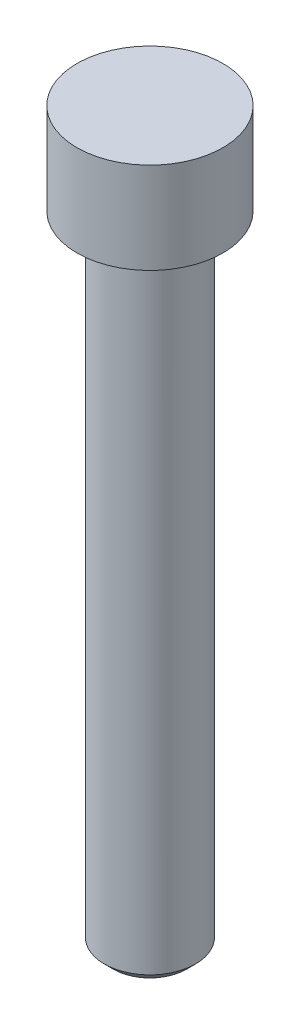
ISO-10303-21;
HEADER;
FILE_DESCRIPTION(('STEP AP214'),'2;1');
FILE_NAME('part.step','',(''),(''),'','','');
FILE_SCHEMA(('AUTOMOTIVE_DESIGN { 1 0 10303 214 1 1 1 1 }'));
ENDSEC;
DATA;
#1=APPLICATION_CONTEXT('core data for automotive mechanical design processes');
#2=APPLICATION_PROTOCOL_DEFINITION('international standard','automotive_design',2000,#1);
#3=PRODUCT_CONTEXT('',#1,'mechanical');
#4=PRODUCT('Part','Part','',(#3));
#5=PRODUCT_RELATED_PRODUCT_CATEGORY('part','',(#4));
#6=PRODUCT_DEFINITION_FORMATION('','',#4);
#7=PRODUCT_DEFINITION_CONTEXT('part definition',#1,'design');
#8=PRODUCT_DEFINITION('design','',#6,#7);
#9=PRODUCT_DEFINITION_SHAPE('','',#8);
#10=(LENGTH_UNIT() NAMED_UNIT(*) SI_UNIT(.MILLI.,.METRE.));
#11=(NAMED_UNIT(*) PLANE_ANGLE_UNIT() SI_UNIT($,.RADIAN.));
#12=(NAMED_UNIT(*) SI_UNIT($,.STERADIAN.) SOLID_ANGLE_UNIT());
#13=UNCERTAINTY_MEASURE_WITH_UNIT(LENGTH_MEASURE(1.E-05),#10,'distance_accuracy_value','');
#14=(GEOMETRIC_REPRESENTATION_CONTEXT(3) GLOBAL_UNCERTAINTY_ASSIGNED_CONTEXT((#13)) GLOBAL_UNIT_ASSIGNED_CONTEXT((#10,
#11,#12)) REPRESENTATION_CONTEXT('',''));
#15=CARTESIAN_POINT('',(0.,0.,0.));
#16=DIRECTION('',(0.,0.,1.));
#17=DIRECTION('',(1.,0.,0.));
#18=AXIS2_PLACEMENT_3D('',#15,#16,#17);
#19=CARTESIAN_POINT('',(0.,10.,0.));
#20=DIRECTION('',(0.,-1.,0.));
#21=DIRECTION('',(0.,0.,-1.));
#22=AXIS2_PLACEMENT_3D('',#19,#20,#21);
#23=CYLINDRICAL_SURFACE('',#22,8.);
#24=CARTESIAN_POINT('',(0.,10.,0.));
#25=DIRECTION('',(0.,1.,0.));
#26=DIRECTION('',(0.,0.,1.));
#27=AXIS2_PLACEMENT_3D('',#24,#25,#26);
#28=CIRCLE('',#27,8.);
#29=CARTESIAN_POINT('',(0.,10.,8.));
#30=VERTEX_POINT('',#29);
#31=EDGE_CURVE('E45',#30,#30,#28,.T.);
#32=ORIENTED_EDGE('',*,*,#31,.F.);
#33=EDGE_LOOP('',(#32));
#34=FACE_BOUND('',#33,.T.);
#35=CARTESIAN_POINT('',(0.,0.,0.));
#36=DIRECTION('',(0.,1.,0.));
#37=DIRECTION('',(0.,0.,1.));
#38=AXIS2_PLACEMENT_3D('',#35,#36,#37);
#39=CIRCLE('',#38,8.);
#40=CARTESIAN_POINT('',(0.,0.,8.));
#41=VERTEX_POINT('',#40);
#42=EDGE_CURVE('E48',#41,#41,#39,.T.);
#43=ORIENTED_EDGE('',*,*,#42,.T.);
#44=EDGE_LOOP('',(#43));
#45=FACE_BOUND('',#44,.T.);
#46=ADVANCED_FACE('F30',(#34,#45),#23,.T.);
#47=CARTESIAN_POINT('',(0.,10.,0.));
#48=DIRECTION('',(0.,1.,0.));
#49=DIRECTION('',(0.,0.,1.));
#50=AXIS2_PLACEMENT_3D('',#47,#48,#49);
#51=PLANE('',#50);
#52=ORIENTED_EDGE('',*,*,#31,.T.);
#53=EDGE_LOOP('',(#52));
#54=FACE_BOUND('',#53,.T.);
#55=ADVANCED_FACE('F54',(#54),#51,.T.);
#56=CARTESIAN_POINT('',(0.,0.,0.));
#57=DIRECTION('',(0.,1.,0.));
#58=DIRECTION('',(0.,0.,1.));
#59=AXIS2_PLACEMENT_3D('',#56,#57,#58);
#60=PLANE('',#59);
#61=CARTESIAN_POINT('',(0.,0.,0.));
#62=DIRECTION('',(0.,1.,0.));
#63=DIRECTION('',(0.,0.,1.));
#64=AXIS2_PLACEMENT_3D('',#61,#62,#63);
#65=CIRCLE('',#64,5.);
#66=CARTESIAN_POINT('',(0.,0.,5.));
#67=VERTEX_POINT('',#66);
#68=EDGE_CURVE('E41',#67,#67,#65,.F.);
#69=ORIENTED_EDGE('',*,*,#68,.F.);
#70=EDGE_LOOP('',(#69));
#71=FACE_BOUND('',#70,.T.);
#72=ORIENTED_EDGE('',*,*,#42,.F.);
#73=EDGE_LOOP('',(#72));
#74=FACE_BOUND('',#73,.T.);
#75=ADVANCED_FACE('F60',(#71,#74),#60,.F.);
#76=CARTESIAN_POINT('',(0.,-70.,0.));
#77=DIRECTION('',(0.,1.,0.));
#78=DIRECTION('',(0.,0.,1.));
#79=AXIS2_PLACEMENT_3D('',#76,#77,#78);
#80=CYLINDRICAL_SURFACE('',#79,5.);
#81=CARTESIAN_POINT('',(0.,-69.,0.));
#82=DIRECTION('',(0.,-1.,0.));
#83=DIRECTION('',(0.,0.,-1.));
#84=AXIS2_PLACEMENT_3D('',#81,#82,#83);
#85=CIRCLE('',#84,5.);
#86=CARTESIAN_POINT('',(0.,-69.,-5.));
#87=VERTEX_POINT('',#86);
#88=EDGE_CURVE('E10',#87,#87,#85,.F.);
#89=ORIENTED_EDGE('',*,*,#88,.T.);
#90=EDGE_LOOP('',(#89));
#91=FACE_BOUND('',#90,.T.);
#92=ORIENTED_EDGE('',*,*,#68,.T.);
#93=EDGE_LOOP('',(#92));
#94=FACE_BOUND('',#93,.T.);
#95=ADVANCED_FACE('F62',(#91,#94),#80,.T.);
#96=CARTESIAN_POINT('',(0.,-70.,0.));
#97=DIRECTION('',(0.,-1.,0.));
#98=DIRECTION('',(0.,0.,-1.));
#99=AXIS2_PLACEMENT_3D('',#96,#97,#98);
#100=PLANE('',#99);
#101=CARTESIAN_POINT('',(0.,-70.,0.));
#102=DIRECTION('',(0.,-1.,0.));
#103=DIRECTION('',(0.,0.,-1.));
#104=AXIS2_PLACEMENT_3D('',#101,#102,#103);
#105=CIRCLE('',#104,4.);
#106=CARTESIAN_POINT('',(0.,-70.,-4.));
#107=VERTEX_POINT('',#106);
#108=EDGE_CURVE('E37',#107,#107,#105,.T.);
#109=ORIENTED_EDGE('',*,*,#108,.T.);
#110=EDGE_LOOP('',(#109));
#111=FACE_BOUND('',#110,.T.);
#112=ADVANCED_FACE('F69',(#111),#100,.T.);
#113=CARTESIAN_POINT('',(0.,-70.,0.));
#114=DIRECTION('',(0.,1.,0.));
#115=DIRECTION('',(0.,0.,1.));
#116=AXIS2_PLACEMENT_3D('',#113,#114,#115);
#117=CONICAL_SURFACE('',#116,4.,0.785398163397439);
#118=ORIENTED_EDGE('',*,*,#88,.F.);
#119=EDGE_LOOP('',(#118));
#120=FACE_BOUND('',#119,.T.);
#121=ORIENTED_EDGE('',*,*,#108,.F.);
#122=EDGE_LOOP('',(#121));
#123=FACE_BOUND('',#122,.T.);
#124=ADVANCED_FACE('F32',(#120,#123),#117,.T.);
#125=CLOSED_SHELL('',(#46,#55,#75,#95,#112,#124));
#126=MANIFOLD_SOLID_BREP('B2',#125);
#127=ADVANCED_BREP_SHAPE_REPRESENTATION('',(#18,#126),#14);
#128=SHAPE_DEFINITION_REPRESENTATION(#9,#127);
ENDSEC;
END-ISO-10303-21;
